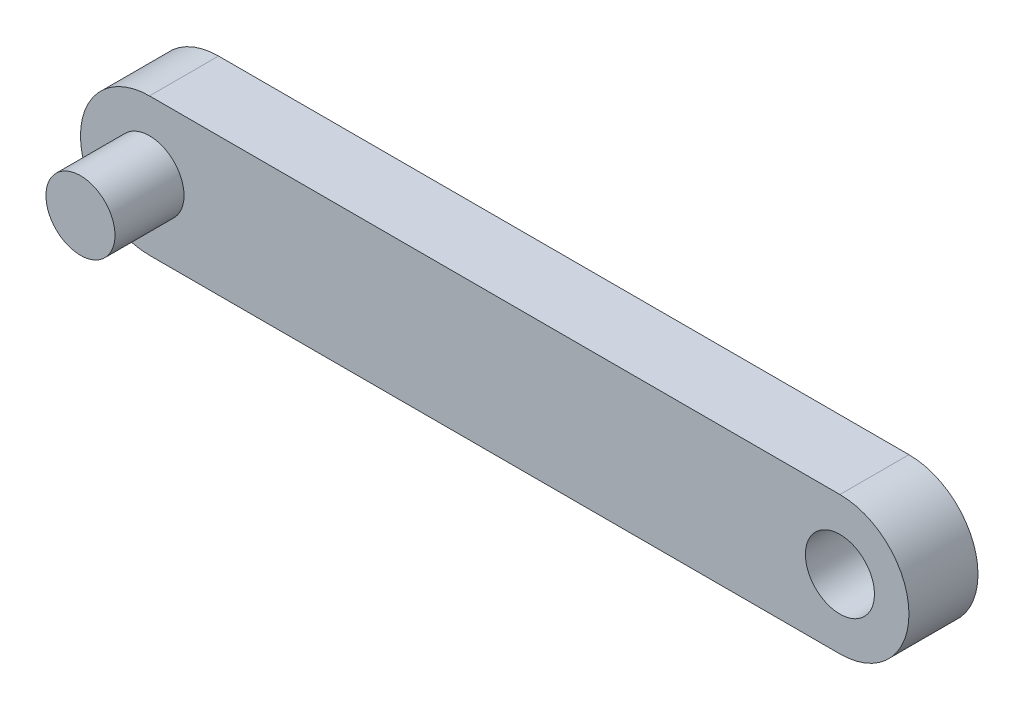
ISO-10303-21;
HEADER;
FILE_DESCRIPTION(('STEP AP214'),'2;1');
FILE_NAME('part.step','',(''),(''),'','','');
FILE_SCHEMA(('AUTOMOTIVE_DESIGN { 1 0 10303 214 1 1 1 1 }'));
ENDSEC;
DATA;
#1=APPLICATION_CONTEXT('core data for automotive mechanical design processes');
#2=APPLICATION_PROTOCOL_DEFINITION('international standard','automotive_design',2000,#1);
#3=PRODUCT_CONTEXT('',#1,'mechanical');
#4=PRODUCT('Part','Part','',(#3));
#5=PRODUCT_RELATED_PRODUCT_CATEGORY('part','',(#4));
#6=PRODUCT_DEFINITION_FORMATION('','',#4);
#7=PRODUCT_DEFINITION_CONTEXT('part definition',#1,'design');
#8=PRODUCT_DEFINITION('design','',#6,#7);
#9=PRODUCT_DEFINITION_SHAPE('','',#8);
#10=(LENGTH_UNIT() NAMED_UNIT(*) SI_UNIT(.MILLI.,.METRE.));
#11=(NAMED_UNIT(*) PLANE_ANGLE_UNIT() SI_UNIT($,.RADIAN.));
#12=(NAMED_UNIT(*) SI_UNIT($,.STERADIAN.) SOLID_ANGLE_UNIT());
#13=UNCERTAINTY_MEASURE_WITH_UNIT(LENGTH_MEASURE(1.E-05),#10,'distance_accuracy_value','');
#14=(GEOMETRIC_REPRESENTATION_CONTEXT(3) GLOBAL_UNCERTAINTY_ASSIGNED_CONTEXT((#13)) GLOBAL_UNIT_ASSIGNED_CONTEXT((#10,
#11,#12)) REPRESENTATION_CONTEXT('',''));
#15=CARTESIAN_POINT('',(0.,0.,0.));
#16=DIRECTION('',(0.,0.,1.));
#17=DIRECTION('',(1.,0.,0.));
#18=AXIS2_PLACEMENT_3D('',#15,#16,#17);
#19=CARTESIAN_POINT('',(-25.,0.,5.));
#20=DIRECTION('',(0.,0.,1.));
#21=DIRECTION('',(1.,0.,0.));
#22=AXIS2_PLACEMENT_3D('',#19,#20,#21);
#23=PLANE('',#22);
#24=CARTESIAN_POINT('',(-25.,0.,5.));
#25=DIRECTION('',(0.,0.,1.));
#26=DIRECTION('',(1.,0.,0.));
#27=AXIS2_PLACEMENT_3D('',#24,#25,#26);
#28=CIRCLE('',#27,2.5);
#29=CARTESIAN_POINT('',(-22.5,0.,5.));
#30=VERTEX_POINT('',#29);
#31=EDGE_CURVE('E102',#30,#30,#28,.T.);
#32=ORIENTED_EDGE('',*,*,#31,.F.);
#33=EDGE_LOOP('',(#32));
#34=FACE_BOUND('',#33,.T.);
#35=CARTESIAN_POINT('',(-25.,0.,5.));
#36=DIRECTION('',(0.,0.,1.));
#37=DIRECTION('',(1.,0.,0.));
#38=AXIS2_PLACEMENT_3D('',#35,#36,#37);
#39=CIRCLE('',#38,5.);
#40=CARTESIAN_POINT('',(-25.,5.,5.));
#41=VERTEX_POINT('',#40);
#42=CARTESIAN_POINT('',(-25.,-5.,5.));
#43=VERTEX_POINT('',#42);
#44=EDGE_CURVE('E87',#41,#43,#39,.T.);
#45=ORIENTED_EDGE('',*,*,#44,.T.);
#46=DIRECTION('',(1.,0.,0.));
#47=VECTOR('',#46,1.);
#48=CARTESIAN_POINT('',(-25.,-5.,5.));
#49=LINE('',#48,#47);
#50=CARTESIAN_POINT('',(25.,-4.99999999999999,5.));
#51=VERTEX_POINT('',#50);
#52=EDGE_CURVE('E82',#43,#51,#49,.T.);
#53=ORIENTED_EDGE('',*,*,#52,.T.);
#54=CARTESIAN_POINT('',(25.,0.,5.));
#55=DIRECTION('',(0.,0.,1.));
#56=DIRECTION('',(1.,0.,0.));
#57=AXIS2_PLACEMENT_3D('',#54,#55,#56);
#58=CIRCLE('',#57,5.);
#59=CARTESIAN_POINT('',(25.,5.00000000000001,5.));
#60=VERTEX_POINT('',#59);
#61=EDGE_CURVE('E85',#51,#60,#58,.T.);
#62=ORIENTED_EDGE('',*,*,#61,.T.);
#63=DIRECTION('',(-1.,0.,0.));
#64=VECTOR('',#63,1.);
#65=CARTESIAN_POINT('',(-25.,5.,5.));
#66=LINE('',#65,#64);
#67=EDGE_CURVE('E52',#60,#41,#66,.T.);
#68=ORIENTED_EDGE('',*,*,#67,.T.);
#69=EDGE_LOOP('',(#45,#53,#62,#68));
#70=FACE_BOUND('',#69,.T.);
#71=CARTESIAN_POINT('',(25.,0.,5.));
#72=DIRECTION('',(0.,0.,1.));
#73=DIRECTION('',(1.,0.,0.));
#74=AXIS2_PLACEMENT_3D('',#71,#72,#73);
#75=CIRCLE('',#74,2.5);
#76=CARTESIAN_POINT('',(27.5,0.,5.));
#77=VERTEX_POINT('',#76);
#78=EDGE_CURVE('E116',#77,#77,#75,.T.);
#79=ORIENTED_EDGE('',*,*,#78,.F.);
#80=EDGE_LOOP('',(#79));
#81=FACE_BOUND('',#80,.T.);
#82=ADVANCED_FACE('F35',(#34,#70,#81),#23,.T.);
#83=CARTESIAN_POINT('',(-25.,0.,0.));
#84=DIRECTION('',(0.,0.,1.));
#85=DIRECTION('',(1.,0.,0.));
#86=AXIS2_PLACEMENT_3D('',#83,#84,#85);
#87=PLANE('',#86);
#88=CARTESIAN_POINT('',(-25.,0.,0.));
#89=DIRECTION('',(0.,0.,1.));
#90=DIRECTION('',(1.,0.,0.));
#91=AXIS2_PLACEMENT_3D('',#88,#89,#90);
#92=CIRCLE('',#91,5.);
#93=CARTESIAN_POINT('',(-25.,5.,0.));
#94=VERTEX_POINT('',#93);
#95=CARTESIAN_POINT('',(-25.,-5.,0.));
#96=VERTEX_POINT('',#95);
#97=EDGE_CURVE('E99',#94,#96,#92,.T.);
#98=ORIENTED_EDGE('',*,*,#97,.F.);
#99=DIRECTION('',(-1.,0.,0.));
#100=VECTOR('',#99,1.);
#101=CARTESIAN_POINT('',(-25.,5.,0.));
#102=LINE('',#101,#100);
#103=CARTESIAN_POINT('',(25.,5.00000000000001,0.));
#104=VERTEX_POINT('',#103);
#105=EDGE_CURVE('E75',#104,#94,#102,.T.);
#106=ORIENTED_EDGE('',*,*,#105,.F.);
#107=CARTESIAN_POINT('',(25.,0.,0.));
#108=DIRECTION('',(0.,0.,1.));
#109=DIRECTION('',(1.,0.,0.));
#110=AXIS2_PLACEMENT_3D('',#107,#108,#109);
#111=CIRCLE('',#110,5.);
#112=CARTESIAN_POINT('',(25.,-4.99999999999999,0.));
#113=VERTEX_POINT('',#112);
#114=EDGE_CURVE('E69',#113,#104,#111,.T.);
#115=ORIENTED_EDGE('',*,*,#114,.F.);
#116=DIRECTION('',(1.,0.,0.));
#117=VECTOR('',#116,1.);
#118=CARTESIAN_POINT('',(-25.,-5.,0.));
#119=LINE('',#118,#117);
#120=EDGE_CURVE('E91',#96,#113,#119,.T.);
#121=ORIENTED_EDGE('',*,*,#120,.F.);
#122=EDGE_LOOP('',(#98,#106,#115,#121));
#123=FACE_BOUND('',#122,.T.);
#124=CARTESIAN_POINT('',(25.,0.,0.));
#125=DIRECTION('',(0.,0.,1.));
#126=DIRECTION('',(1.,0.,0.));
#127=AXIS2_PLACEMENT_3D('',#124,#125,#126);
#128=CIRCLE('',#127,2.5);
#129=CARTESIAN_POINT('',(27.5,0.,0.));
#130=VERTEX_POINT('',#129);
#131=EDGE_CURVE('E117',#130,#130,#128,.T.);
#132=ORIENTED_EDGE('',*,*,#131,.T.);
#133=EDGE_LOOP('',(#132));
#134=FACE_BOUND('',#133,.T.);
#135=ADVANCED_FACE('F110',(#123,#134),#87,.F.);
#136=CARTESIAN_POINT('',(-25.,0.,5.));
#137=DIRECTION('',(0.,0.,-1.));
#138=DIRECTION('',(-1.,0.,0.));
#139=AXIS2_PLACEMENT_3D('',#136,#137,#138);
#140=CYLINDRICAL_SURFACE('',#139,5.);
#141=ORIENTED_EDGE('',*,*,#97,.T.);
#142=DIRECTION('',(0.,0.,-1.));
#143=VECTOR('',#142,1.);
#144=CARTESIAN_POINT('',(-25.,-5.,5.));
#145=LINE('',#144,#143);
#146=EDGE_CURVE('E11',#43,#96,#145,.T.);
#147=ORIENTED_EDGE('',*,*,#146,.F.);
#148=ORIENTED_EDGE('',*,*,#44,.F.);
#149=DIRECTION('',(0.,0.,-1.));
#150=VECTOR('',#149,1.);
#151=CARTESIAN_POINT('',(-25.,5.,5.));
#152=LINE('',#151,#150);
#153=EDGE_CURVE('E95',#41,#94,#152,.T.);
#154=ORIENTED_EDGE('',*,*,#153,.T.);
#155=EDGE_LOOP('',(#141,#147,#148,#154));
#156=FACE_BOUND('',#155,.T.);
#157=ADVANCED_FACE('F37',(#156),#140,.T.);
#158=CARTESIAN_POINT('',(-25.,-5.,5.));
#159=DIRECTION('',(0.,1.,0.));
#160=DIRECTION('',(-1.,0.,0.));
#161=AXIS2_PLACEMENT_3D('',#158,#159,#160);
#162=PLANE('',#161);
#163=ORIENTED_EDGE('',*,*,#120,.T.);
#164=DIRECTION('',(0.,0.,-1.));
#165=VECTOR('',#164,1.);
#166=CARTESIAN_POINT('',(25.,-4.99999999999999,5.));
#167=LINE('',#166,#165);
#168=EDGE_CURVE('E44',#51,#113,#167,.T.);
#169=ORIENTED_EDGE('',*,*,#168,.F.);
#170=ORIENTED_EDGE('',*,*,#52,.F.);
#171=ORIENTED_EDGE('',*,*,#146,.T.);
#172=EDGE_LOOP('',(#163,#169,#170,#171));
#173=FACE_BOUND('',#172,.T.);
#174=ADVANCED_FACE('F90',(#173),#162,.F.);
#175=CARTESIAN_POINT('',(25.,0.,5.));
#176=DIRECTION('',(0.,0.,-1.));
#177=DIRECTION('',(-1.,0.,0.));
#178=AXIS2_PLACEMENT_3D('',#175,#176,#177);
#179=CYLINDRICAL_SURFACE('',#178,5.);
#180=ORIENTED_EDGE('',*,*,#114,.T.);
#181=DIRECTION('',(0.,0.,-1.));
#182=VECTOR('',#181,1.);
#183=CARTESIAN_POINT('',(25.,5.00000000000001,5.));
#184=LINE('',#183,#182);
#185=EDGE_CURVE('E92',#60,#104,#184,.T.);
#186=ORIENTED_EDGE('',*,*,#185,.F.);
#187=ORIENTED_EDGE('',*,*,#61,.F.);
#188=ORIENTED_EDGE('',*,*,#168,.T.);
#189=EDGE_LOOP('',(#180,#186,#187,#188));
#190=FACE_BOUND('',#189,.T.);
#191=ADVANCED_FACE('F93',(#190),#179,.T.);
#192=CARTESIAN_POINT('',(-25.,5.,5.));
#193=DIRECTION('',(0.,-1.,0.));
#194=DIRECTION('',(1.,0.,0.));
#195=AXIS2_PLACEMENT_3D('',#192,#193,#194);
#196=PLANE('',#195);
#197=ORIENTED_EDGE('',*,*,#105,.T.);
#198=ORIENTED_EDGE('',*,*,#153,.F.);
#199=ORIENTED_EDGE('',*,*,#67,.F.);
#200=ORIENTED_EDGE('',*,*,#185,.T.);
#201=EDGE_LOOP('',(#197,#198,#199,#200));
#202=FACE_BOUND('',#201,.T.);
#203=ADVANCED_FACE('F107',(#202),#196,.F.);
#204=CARTESIAN_POINT('',(25.,0.,5.));
#205=DIRECTION('',(0.,0.,-1.));
#206=DIRECTION('',(-1.,0.,0.));
#207=AXIS2_PLACEMENT_3D('',#204,#205,#206);
#208=CYLINDRICAL_SURFACE('',#207,2.5);
#209=ORIENTED_EDGE('',*,*,#78,.T.);
#210=EDGE_LOOP('',(#209));
#211=FACE_BOUND('',#210,.T.);
#212=ORIENTED_EDGE('',*,*,#131,.F.);
#213=EDGE_LOOP('',(#212));
#214=FACE_BOUND('',#213,.T.);
#215=ADVANCED_FACE('F130',(#211,#214),#208,.F.);
#216=CARTESIAN_POINT('',(-25.,0.,10.));
#217=DIRECTION('',(0.,0.,-1.));
#218=DIRECTION('',(-1.,0.,0.));
#219=AXIS2_PLACEMENT_3D('',#216,#217,#218);
#220=CYLINDRICAL_SURFACE('',#219,2.5);
#221=ORIENTED_EDGE('',*,*,#31,.T.);
#222=EDGE_LOOP('',(#221));
#223=FACE_BOUND('',#222,.T.);
#224=CARTESIAN_POINT('',(-25.,0.,10.));
#225=DIRECTION('',(0.,0.,1.));
#226=DIRECTION('',(1.,0.,0.));
#227=AXIS2_PLACEMENT_3D('',#224,#225,#226);
#228=CIRCLE('',#227,2.5);
#229=CARTESIAN_POINT('',(-22.5,0.,10.));
#230=VERTEX_POINT('',#229);
#231=EDGE_CURVE('E120',#230,#230,#228,.T.);
#232=ORIENTED_EDGE('',*,*,#231,.F.);
#233=EDGE_LOOP('',(#232));
#234=FACE_BOUND('',#233,.T.);
#235=ADVANCED_FACE('F128',(#223,#234),#220,.T.);
#236=CARTESIAN_POINT('',(0.,0.,10.));
#237=DIRECTION('',(0.,0.,1.));
#238=DIRECTION('',(1.,0.,0.));
#239=AXIS2_PLACEMENT_3D('',#236,#237,#238);
#240=PLANE('',#239);
#241=ORIENTED_EDGE('',*,*,#231,.T.);
#242=EDGE_LOOP('',(#241));
#243=FACE_BOUND('',#242,.T.);
#244=ADVANCED_FACE('F126',(#243),#240,.T.);
#245=CLOSED_SHELL('',(#82,#135,#157,#174,#191,#203,#215,#235,#244));
#246=MANIFOLD_SOLID_BREP('B2',#245);
#247=ADVANCED_BREP_SHAPE_REPRESENTATION('',(#18,#246),#14);
#248=SHAPE_DEFINITION_REPRESENTATION(#9,#247);
ENDSEC;
END-ISO-10303-21;
